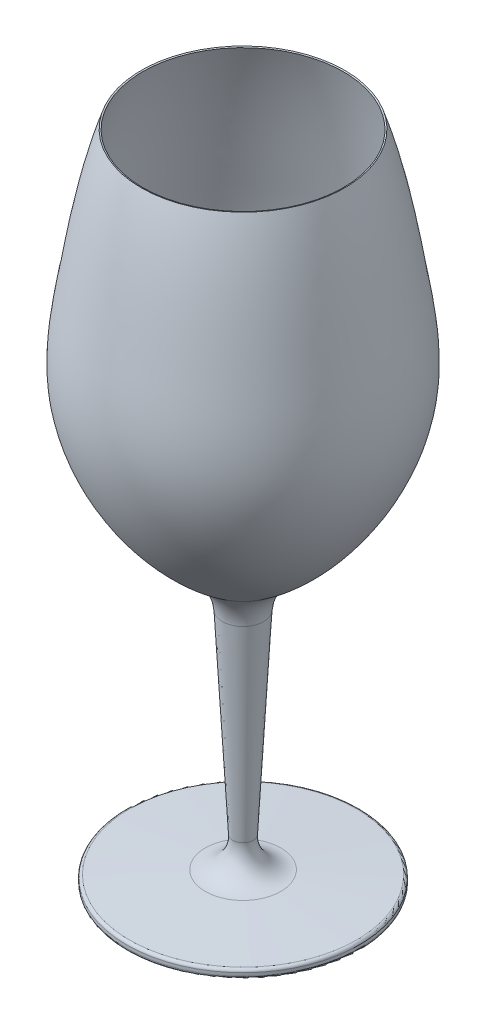
ISO-10303-21;
HEADER;
FILE_DESCRIPTION(('STEP AP214'),'2;1');
FILE_NAME('part.step','',(''),(''),'','','');
FILE_SCHEMA(('AUTOMOTIVE_DESIGN { 1 0 10303 214 1 1 1 1 }'));
ENDSEC;
DATA;
#1=APPLICATION_CONTEXT('core data for automotive mechanical design processes');
#2=APPLICATION_PROTOCOL_DEFINITION('international standard','automotive_design',2000,#1);
#3=PRODUCT_CONTEXT('',#1,'mechanical');
#4=PRODUCT('Part','Part','',(#3));
#5=PRODUCT_RELATED_PRODUCT_CATEGORY('part','',(#4));
#6=PRODUCT_DEFINITION_FORMATION('','',#4);
#7=PRODUCT_DEFINITION_CONTEXT('part definition',#1,'design');
#8=PRODUCT_DEFINITION('design','',#6,#7);
#9=PRODUCT_DEFINITION_SHAPE('','',#8);
#10=(LENGTH_UNIT() NAMED_UNIT(*) SI_UNIT(.MILLI.,.METRE.));
#11=(NAMED_UNIT(*) PLANE_ANGLE_UNIT() SI_UNIT($,.RADIAN.));
#12=(NAMED_UNIT(*) SI_UNIT($,.STERADIAN.) SOLID_ANGLE_UNIT());
#13=UNCERTAINTY_MEASURE_WITH_UNIT(LENGTH_MEASURE(1.E-05),#10,'distance_accuracy_value','');
#14=(GEOMETRIC_REPRESENTATION_CONTEXT(3) GLOBAL_UNCERTAINTY_ASSIGNED_CONTEXT((#13)) GLOBAL_UNIT_ASSIGNED_CONTEXT((#10,
#11,#12)) REPRESENTATION_CONTEXT('',''));
#15=CARTESIAN_POINT('',(0.,0.,0.));
#16=DIRECTION('',(0.,0.,1.));
#17=DIRECTION('',(1.,0.,0.));
#18=AXIS2_PLACEMENT_3D('',#15,#16,#17);
#19=CARTESIAN_POINT('',(7.5,90.5,0.));
#20=DIRECTION('',(0.,-1.,0.));
#21=DIRECTION('',(0.,0.,-1.));
#22=AXIS2_PLACEMENT_3D('',#19,#20,#21);
#23=PLANE('',#22);
#24=CARTESIAN_POINT('',(0.,90.5,0.));
#25=DIRECTION('',(0.,1.,0.));
#26=DIRECTION('',(0.,0.,1.));
#27=AXIS2_PLACEMENT_3D('',#24,#25,#26);
#28=CIRCLE('',#27,7.36580755563534);
#29=CARTESIAN_POINT('',(0.,90.5,7.36580755563534));
#30=VERTEX_POINT('',#29);
#31=EDGE_CURVE('E85',#30,#30,#28,.T.);
#32=ORIENTED_EDGE('',*,*,#31,.T.);
#33=EDGE_LOOP('',(#32));
#34=FACE_BOUND('',#33,.T.);
#35=ADVANCED_FACE('F37',(#34),#23,.F.);
#36=CARTESIAN_POINT('',(35.,225.,0.));
#37=CARTESIAN_POINT('',(39.9170201792758,210.365056176156,0.));
#38=CARTESIAN_POINT('',(44.1056743266489,185.466353245277,0.));
#39=CARTESIAN_POINT('',(52.4361400505516,135.138835851977,0.));
#40=CARTESIAN_POINT('',(28.2814009491732,101.995192324676,0.));
#41=CARTESIAN_POINT('',(7.49999999999999,90.,0.));
#42=B_SPLINE_CURVE_WITH_KNOTS('',3,(#36,#37,#38,#39,#40,#41),.UNSPECIFIED.,.F.,.F.,(4,1,1,4),
(0.,0.30696974385016,0.507280242844437,1.),.UNSPECIFIED.);
#43=CARTESIAN_POINT('',(0.,231.75,0.));
#44=DIRECTION('',(0.,1.,0.));
#45=AXIS1_PLACEMENT('',#43,#44);
#46=SURFACE_OF_REVOLUTION('',#42,#45);
#47=CARTESIAN_POINT('',(0.,94.0246612386085,0.));
#48=DIRECTION('',(0.,1.,0.));
#49=DIRECTION('',(0.,0.,1.));
#50=AXIS2_PLACEMENT_3D('',#47,#48,#49);
#51=CIRCLE('',#50,13.7404106026119);
#52=CARTESIAN_POINT('',(0.,94.0246612386085,13.7404106026119));
#53=VERTEX_POINT('',#52);
#54=EDGE_CURVE('E65',#53,#53,#51,.T.);
#55=ORIENTED_EDGE('',*,*,#54,.T.);
#56=EDGE_LOOP('',(#55));
#57=FACE_BOUND('',#56,.T.);
#58=CARTESIAN_POINT('',(0.,225.,0.));
#59=DIRECTION('',(0.,1.,0.));
#60=DIRECTION('',(0.,0.,1.));
#61=AXIS2_PLACEMENT_3D('',#58,#59,#60);
#62=CIRCLE('',#61,35.);
#63=CARTESIAN_POINT('',(0.,225.,35.));
#64=VERTEX_POINT('',#63);
#65=EDGE_CURVE('E77',#64,#64,#62,.T.);
#66=ORIENTED_EDGE('',*,*,#65,.F.);
#67=EDGE_LOOP('',(#66));
#68=FACE_BOUND('',#67,.T.);
#69=ADVANCED_FACE('F110',(#57,#68),#46,.F.);
#70=CARTESIAN_POINT('',(0.,224.840758404647,0.));
#71=DIRECTION('',(0.,1.,0.));
#72=DIRECTION('',(0.,0.,1.));
#73=AXIS2_PLACEMENT_3D('',#70,#71,#72);
#74=CONICAL_SURFACE('',#73,34.5260357457473,1.24666740101103);
#75=ORIENTED_EDGE('',*,*,#65,.T.);
#76=EDGE_LOOP('',(#75));
#77=FACE_BOUND('',#76,.T.);
#78=CARTESIAN_POINT('',(0.,224.840758404647,0.));
#79=DIRECTION('',(0.,1.,0.));
#80=DIRECTION('',(0.,0.,1.));
#81=AXIS2_PLACEMENT_3D('',#78,#79,#80);
#82=CIRCLE('',#81,34.5260357457473);
#83=CARTESIAN_POINT('',(0.,224.840758404647,34.5260357457473));
#84=VERTEX_POINT('',#83);
#85=EDGE_CURVE('E81',#84,#84,#82,.T.);
#86=ORIENTED_EDGE('',*,*,#85,.F.);
#87=EDGE_LOOP('',(#86));
#88=FACE_BOUND('',#87,.T.);
#89=ADVANCED_FACE('F105',(#77,#88),#74,.F.);
#90=CARTESIAN_POINT('',(34.5260357457473,224.840758404647,0.));
#91=CARTESIAN_POINT('',(38.5134237229265,212.972757680174,0.));
#92=CARTESIAN_POINT('',(40.9330721074188,200.804932363677,0.));
#93=CARTESIAN_POINT('',(43.6025770812448,185.350494263988,0.));
#94=CARTESIAN_POINT('',(44.1195015259819,182.246673106994,0.));
#95=CARTESIAN_POINT('',(45.1551011310871,176.021305771008,0.));
#96=CARTESIAN_POINT('',(45.6664132655203,172.903480540182,0.));
#97=CARTESIAN_POINT('',(46.9540801874856,163.5571058913,0.));
#98=CARTESIAN_POINT('',(47.483447686818,157.336251857612,0.));
#99=CARTESIAN_POINT('',(46.887857201014,148.109063780249,0.));
#100=CARTESIAN_POINT('',(46.4484540362197,145.046089868041,0.));
#101=CARTESIAN_POINT('',(45.1248415608101,138.980779569992,0.));
#102=CARTESIAN_POINT('',(44.2420199226576,135.979713915717,0.));
#103=CARTESIAN_POINT('',(40.9995332141692,127.1369328505,0.));
#104=CARTESIAN_POINT('',(38.0456792538947,121.455648509251,0.));
#105=CARTESIAN_POINT('',(27.3662952808405,105.581699817172,0.));
#106=CARTESIAN_POINT('',(17.8215249659856,96.5608248764769,0.));
#107=CARTESIAN_POINT('',(7.36580755563534,90.5,0.));
#108=B_SPLINE_CURVE_WITH_KNOTS('',3,(#90,#91,#92,#93,#94,#95,#96,#97,#98,#99,#100,#101,#102,
#103,#104,#105,#106,#107),.UNSPECIFIED.,.F.,.F.,(4,2,2,2,2,2,2,2,4),(0.,0.249999999999999,
0.312499999999999,0.375,0.5,0.5625,0.625,0.75,1.),.UNSPECIFIED.);
#109=CARTESIAN_POINT('',(0.,231.75,0.));
#110=DIRECTION('',(0.,1.,0.));
#111=AXIS1_PLACEMENT('',#109,#110);
#112=SURFACE_OF_REVOLUTION('',#108,#111);
#113=ORIENTED_EDGE('',*,*,#31,.F.);
#114=EDGE_LOOP('',(#113));
#115=FACE_BOUND('',#114,.T.);
#116=ORIENTED_EDGE('',*,*,#85,.T.);
#117=EDGE_LOOP('',(#116));
#118=FACE_BOUND('',#117,.T.);
#119=ADVANCED_FACE('F100',(#115,#118),#112,.T.);
#120=CARTESIAN_POINT('',(0.,0.,0.));
#121=DIRECTION('',(0.,1.,0.));
#122=DIRECTION('',(0.,0.,1.));
#123=AXIS2_PLACEMENT_3D('',#120,#121,#122);
#124=PLANE('',#123);
#125=CARTESIAN_POINT('',(0.,0.,0.));
#126=DIRECTION('',(0.,1.,0.));
#127=DIRECTION('',(0.,0.,1.));
#128=AXIS2_PLACEMENT_3D('',#125,#126,#127);
#129=CIRCLE('',#128,39.);
#130=CARTESIAN_POINT('',(0.,0.,39.));
#131=VERTEX_POINT('',#130);
#132=EDGE_CURVE('E45',#131,#131,#129,.F.);
#133=ORIENTED_EDGE('',*,*,#132,.T.);
#134=EDGE_LOOP('',(#133));
#135=FACE_BOUND('',#134,.T.);
#136=ADVANCED_FACE('F104',(#135),#124,.F.);
#137=CARTESIAN_POINT('',(0.,231.75,0.));
#138=DIRECTION('',(0.,1.,0.));
#139=DIRECTION('',(0.,0.,1.));
#140=AXIS2_PLACEMENT_3D('',#137,#138,#139);
#141=CYLINDRICAL_SURFACE('',#140,40.);
#142=CARTESIAN_POINT('',(0.,1.,0.));
#143=DIRECTION('',(0.,1.,0.));
#144=DIRECTION('',(0.,0.,1.));
#145=AXIS2_PLACEMENT_3D('',#142,#143,#144);
#146=CIRCLE('',#145,40.);
#147=CARTESIAN_POINT('',(0.,1.,40.));
#148=VERTEX_POINT('',#147);
#149=EDGE_CURVE('E50',#148,#148,#146,.T.);
#150=ORIENTED_EDGE('',*,*,#149,.T.);
#151=EDGE_LOOP('',(#150));
#152=FACE_BOUND('',#151,.T.);
#153=CARTESIAN_POINT('',(0.,2.05259419926224,0.));
#154=DIRECTION('',(0.,-1.,0.));
#155=DIRECTION('',(0.,0.,-1.));
#156=AXIS2_PLACEMENT_3D('',#153,#154,#155);
#157=CIRCLE('',#156,40.);
#158=CARTESIAN_POINT('',(0.,2.05259419926224,-40.));
#159=VERTEX_POINT('',#158);
#160=EDGE_CURVE('E55',#159,#159,#157,.T.);
#161=ORIENTED_EDGE('',*,*,#160,.T.);
#162=EDGE_LOOP('',(#161));
#163=FACE_BOUND('',#162,.T.);
#164=ADVANCED_FACE('F136',(#152,#163),#141,.T.);
#165=CARTESIAN_POINT('',(0.,3.,0.));
#166=DIRECTION('',(0.,-1.,0.));
#167=DIRECTION('',(0.,0.,-1.));
#168=AXIS2_PLACEMENT_3D('',#165,#166,#167);
#169=CONICAL_SURFACE('',#168,40.,1.51679482641893);
#170=CARTESIAN_POINT('',(0.,3.05113647253973,0.));
#171=DIRECTION('',(0.,1.,0.));
#172=DIRECTION('',(0.,0.,1.));
#173=AXIS2_PLACEMENT_3D('',#170,#171,#172);
#174=CIRCLE('',#173,39.053975258015);
#175=CARTESIAN_POINT('',(0.,3.05113647253973,-39.053975258015));
#176=VERTEX_POINT('',#175);
#177=EDGE_CURVE('E10',#176,#176,#174,.T.);
#178=CARTESIAN_POINT('',(0.,4.46084605201327,0.));
#179=DIRECTION('',(0.,-1.,0.));
#180=DIRECTION('',(0.,0.,-1.));
#181=AXIS2_PLACEMENT_3D('',#178,#179,#180);
#182=CIRCLE('',#181,12.9743480377545);
#183=CARTESIAN_POINT('',(0.,4.46084605201327,-12.9743480377545));
#184=VERTEX_POINT('',#183);
#185=EDGE_CURVE('E69',#184,#184,#182,.T.);
#186=CARTESIAN_POINT('',(0.,3.05113647253973,-39.053975258015));
#187=CARTESIAN_POINT('',(0.,3.06582094732591,-38.7823124744706));
#188=CARTESIAN_POINT('',(0.,3.0805054221121,-38.5106496909263));
#189=CARTESIAN_POINT('',(0.,3.10987437168446,-37.9673241238375));
#190=CARTESIAN_POINT('',(0.,3.12455884647065,-37.6956613402931));
#191=CARTESIAN_POINT('',(0.,3.15392779604301,-37.1523357732043));
#192=CARTESIAN_POINT('',(0.,3.16861227082919,-36.88067298966));
#193=CARTESIAN_POINT('',(0.,3.19798122040156,-36.3373474225712));
#194=CARTESIAN_POINT('',(0.,3.21266569518774,-36.0656846390268));
#195=CARTESIAN_POINT('',(0.,3.24203464476011,-35.5223590719381));
#196=CARTESIAN_POINT('',(0.,3.25671911954629,-35.2506962883937));
#197=CARTESIAN_POINT('',(0.,3.28608806911866,-34.7073707213049));
#198=CARTESIAN_POINT('',(0.,3.30077254390484,-34.4357079377605));
#199=CARTESIAN_POINT('',(0.,3.3301414934772,-33.8923823706718));
#200=CARTESIAN_POINT('',(0.,3.34482596826339,-33.6207195871274));
#201=CARTESIAN_POINT('',(0.,3.37419491783575,-33.0773940200386));
#202=CARTESIAN_POINT('',(0.,3.38887939262193,-32.8057312364943));
#203=CARTESIAN_POINT('',(0.,3.4182483421943,-32.2624056694055));
#204=CARTESIAN_POINT('',(0.,3.43293281698048,-31.9907428858611));
#205=CARTESIAN_POINT('',(0.,3.46230176655285,-31.4474173187724));
#206=CARTESIAN_POINT('',(0.,3.47698624133903,-31.175754535228));
#207=CARTESIAN_POINT('',(0.,3.5063551909114,-30.6324289681392));
#208=CARTESIAN_POINT('',(0.,3.52103966569758,-30.3607661845948));
#209=CARTESIAN_POINT('',(0.,3.55040861526994,-29.8174406175061));
#210=CARTESIAN_POINT('',(0.,3.56509309005613,-29.5457778339617));
#211=CARTESIAN_POINT('',(0.,3.59446203962849,-29.0024522668729));
#212=CARTESIAN_POINT('',(0.,3.60914651441468,-28.7307894833285));
#213=CARTESIAN_POINT('',(0.,3.63851546398704,-28.1874639162398));
#214=CARTESIAN_POINT('',(0.,3.65319993877322,-27.9158011326954));
#215=CARTESIAN_POINT('',(0.,3.68256888834559,-27.3724755656066));
#216=CARTESIAN_POINT('',(0.,3.69725336313177,-27.1008127820623));
#217=CARTESIAN_POINT('',(0.,3.72662231270414,-26.5574872149735));
#218=CARTESIAN_POINT('',(0.,3.74130678749032,-26.2858244314291));
#219=CARTESIAN_POINT('',(0.,3.77067573706269,-25.7424988643404));
#220=CARTESIAN_POINT('',(0.,3.78536021184887,-25.470836080796));
#221=CARTESIAN_POINT('',(0.,3.81472916142123,-24.9275105137072));
#222=CARTESIAN_POINT('',(0.,3.82941363620742,-24.6558477301628));
#223=CARTESIAN_POINT('',(0.,3.85878258577978,-24.1125221630741));
#224=CARTESIAN_POINT('',(0.,3.87346706056596,-23.8408593795297));
#225=CARTESIAN_POINT('',(0.,3.90283601013833,-23.2975338124409));
#226=CARTESIAN_POINT('',(0.,3.91752048492451,-23.0258710288966));
#227=CARTESIAN_POINT('',(0.,3.94688943449688,-22.4825454618078));
#228=CARTESIAN_POINT('',(0.,3.96157390928306,-22.2108826782634));
#229=CARTESIAN_POINT('',(0.,3.99094285885543,-21.6675571111746));
#230=CARTESIAN_POINT('',(0.,4.00562733364161,-21.3958943276303));
#231=CARTESIAN_POINT('',(0.,4.03499628321397,-20.8525687605415));
#232=CARTESIAN_POINT('',(0.,4.04968075800016,-20.5809059769971));
#233=CARTESIAN_POINT('',(0.,4.07904970757252,-20.0375804099084));
#234=CARTESIAN_POINT('',(0.,4.09373418235871,-19.765917626364));
#235=CARTESIAN_POINT('',(0.,4.12310313193107,-19.2225920592752));
#236=CARTESIAN_POINT('',(0.,4.13778760671725,-18.9509292757308));
#237=CARTESIAN_POINT('',(0.,4.16715655628962,-18.4076037086421));
#238=CARTESIAN_POINT('',(0.,4.1818410310758,-18.1359409250977));
#239=CARTESIAN_POINT('',(0.,4.21120998064817,-17.5926153580089));
#240=CARTESIAN_POINT('',(0.,4.22589445543435,-17.3209525744646));
#241=CARTESIAN_POINT('',(0.,4.25526340500672,-16.7776270073758));
#242=CARTESIAN_POINT('',(0.,4.2699478797929,-16.5059642238314));
#243=CARTESIAN_POINT('',(0.,4.29931682936526,-15.9626386567427));
#244=CARTESIAN_POINT('',(0.,4.31400130415145,-15.6909758731983));
#245=CARTESIAN_POINT('',(0.,4.34337025372381,-15.1476503061095));
#246=CARTESIAN_POINT('',(0.,4.35805472850999,-14.8759875225651));
#247=CARTESIAN_POINT('',(0.,4.38742367808236,-14.3326619554764));
#248=CARTESIAN_POINT('',(0.,4.40210815286854,-14.060999171932));
#249=CARTESIAN_POINT('',(0.,4.43147710244091,-13.5176736048432));
#250=CARTESIAN_POINT('',(0.,4.44616157722709,-13.2460108212988));
#251=CARTESIAN_POINT('',(0.,4.46084605201327,-12.9743480377545));
#252=B_SPLINE_CURVE_WITH_KNOTS('',3,(#186,#187,#188,#189,#190,#191,#192,#193,#194,#195,#196,
#197,#198,#199,#200,#201,#202,#203,#204,#205,#206,#207,#208,#209,#210,#211,#212,#213,#214,#215,
#216,#217,#218,#219,#220,#221,#222,#223,#224,#225,#226,#227,#228,#229,#230,#231,#232,#233,#234,
#235,#236,#237,#238,#239,#240,#241,#242,#243,#244,#245,#246,#247,#248,#249,#250,#251),
.UNSPECIFIED.,.F.,.F.,(4,2,2,2,2,2,2,2,2,2,2,2,2,2,2,2,2,2,2,2,2,2,2,2,2,2,2,2,2,2,2,2,4),(0.,
0.816178115282103,1.63235623056421,2.4485343458463,3.2647124611284,4.08089057641051,
4.89706869169261,5.71324680697471,6.52942492225681,7.34560303753891,8.16178115282101,
8.97795926810311,9.79413738338522,10.6103154986673,11.4264936139494,12.2426717292315,
13.0588498445136,13.8750279597957,14.6912060750778,15.5073841903599,16.323562305642,
17.1397404209241,17.9559185362062,18.7720966514883,19.5882747667704,20.4044528820525,
21.2206309973346,22.0368091126167,22.8529872278989,23.669165343181,24.4853434584631,
25.3015215737452,26.1176996890273),.UNSPECIFIED.);
#253=EDGE_CURVE('BSEAM139',#176,#184,#252,.T.);
#254=ORIENTED_EDGE('',*,*,#177,.T.);
#255=ORIENTED_EDGE('',*,*,#185,.T.);
#256=ORIENTED_EDGE('',*,*,#253,.T.);
#257=ORIENTED_EDGE('',*,*,#253,.F.);
#258=EDGE_LOOP('',(#254,#256,#255,#257));
#259=FACE_BOUND('',#258,.T.);
#260=ADVANCED_FACE('F139',(#259),#169,.T.);
#261=CARTESIAN_POINT('',(0.,5.,0.));
#262=DIRECTION('',(0.,1.,0.));
#263=DIRECTION('',(0.,0.,1.));
#264=AXIS2_PLACEMENT_3D('',#261,#262,#263);
#265=CONICAL_SURFACE('',#264,3.00000000000001,0.0528917988657199);
#266=CARTESIAN_POINT('',(0.,81.8552378264217,0.));
#267=DIRECTION('',(0.,-1.,0.));
#268=DIRECTION('',(0.,0.,-1.));
#269=AXIS2_PLACEMENT_3D('',#266,#267,#268);
#270=CIRCLE('',#269,7.06880670845761);
#271=CARTESIAN_POINT('',(0.,81.8552378264217,-7.06880670845761));
#272=VERTEX_POINT('',#271);
#273=EDGE_CURVE('E61',#272,#272,#270,.T.);
#274=ORIENTED_EDGE('',*,*,#273,.T.);
#275=EDGE_LOOP('',(#274));
#276=FACE_BOUND('',#275,.T.);
#277=CARTESIAN_POINT('',(0.,14.9749401961898,0.));
#278=DIRECTION('',(0.,1.,0.));
#279=DIRECTION('',(0.,0.,1.));
#280=AXIS2_PLACEMENT_3D('',#277,#278,#279);
#281=CIRCLE('',#280,3.52808506921006);
#282=CARTESIAN_POINT('',(0.,14.9749401961898,3.52808506921006));
#283=VERTEX_POINT('',#282);
#284=EDGE_CURVE('E73',#283,#283,#281,.T.);
#285=ORIENTED_EDGE('',*,*,#284,.T.);
#286=EDGE_LOOP('',(#285));
#287=FACE_BOUND('',#286,.T.);
#288=ADVANCED_FACE('F122',(#276,#287),#265,.T.);
#289=CARTESIAN_POINT('',(0.,14.4462687847884,0.));
#290=DIRECTION('',(0.,1.,0.));
#291=DIRECTION('',(0.,0.,1.));
#292=AXIS2_PLACEMENT_3D('',#289,#290,#291);
#293=TOROIDAL_SURFACE('',#292,13.5141006179045,10.);
#294=ORIENTED_EDGE('',*,*,#185,.F.);
#295=EDGE_LOOP('',(#294));
#296=FACE_BOUND('',#295,.T.);
#297=ORIENTED_EDGE('',*,*,#284,.F.);
#298=EDGE_LOOP('',(#297));
#299=FACE_BOUND('',#298,.T.);
#300=ADVANCED_FACE('F118',(#296,#299),#293,.F.);
#301=CARTESIAN_POINT('',(0.,81.0093635681793,0.));
#302=DIRECTION('',(0.,1.,0.));
#303=DIRECTION('',(0.,0.,1.));
#304=AXIS2_PLACEMENT_3D('',#301,#302,#303);
#305=TOROIDAL_SURFACE('',#304,23.0464315863687,16.);
#306=ORIENTED_EDGE('',*,*,#273,.F.);
#307=EDGE_LOOP('',(#306));
#308=FACE_BOUND('',#307,.T.);
#309=ORIENTED_EDGE('',*,*,#54,.F.);
#310=EDGE_LOOP('',(#309));
#311=FACE_BOUND('',#310,.T.);
#312=ADVANCED_FACE('F121',(#308,#311),#305,.F.);
#313=CARTESIAN_POINT('',(0.,1.,0.));
#314=DIRECTION('',(0.,1.,0.));
#315=DIRECTION('',(0.,0.,1.));
#316=AXIS2_PLACEMENT_3D('',#313,#314,#315);
#317=TOROIDAL_SURFACE('',#316,39.,1.);
#318=ORIENTED_EDGE('',*,*,#132,.F.);
#319=EDGE_LOOP('',(#318));
#320=FACE_BOUND('',#319,.T.);
#321=ORIENTED_EDGE('',*,*,#149,.F.);
#322=EDGE_LOOP('',(#321));
#323=FACE_BOUND('',#322,.T.);
#324=ADVANCED_FACE('F125',(#320,#323),#317,.T.);
#325=CARTESIAN_POINT('',(0.,2.05259419926224,0.));
#326=DIRECTION('',(0.,-1.,0.));
#327=DIRECTION('',(0.,0.,-1.));
#328=AXIS2_PLACEMENT_3D('',#325,#326,#327);
#329=TOROIDAL_SURFACE('',#328,39.,1.);
#330=ORIENTED_EDGE('',*,*,#160,.F.);
#331=EDGE_LOOP('',(#330));
#332=FACE_BOUND('',#331,.T.);
#333=ORIENTED_EDGE('',*,*,#177,.F.);
#334=EDGE_LOOP('',(#333));
#335=FACE_BOUND('',#334,.T.);
#336=ADVANCED_FACE('F39',(#332,#335),#329,.T.);
#337=CLOSED_SHELL('',(#35,#69,#89,#119,#136,#164,#260,#288,#300,#312,#324,#336));
#338=MANIFOLD_SOLID_BREP('B2',#337);
#339=ADVANCED_BREP_SHAPE_REPRESENTATION('',(#18,#338),#14);
#340=SHAPE_DEFINITION_REPRESENTATION(#9,#339);
ENDSEC;
END-ISO-10303-21;
